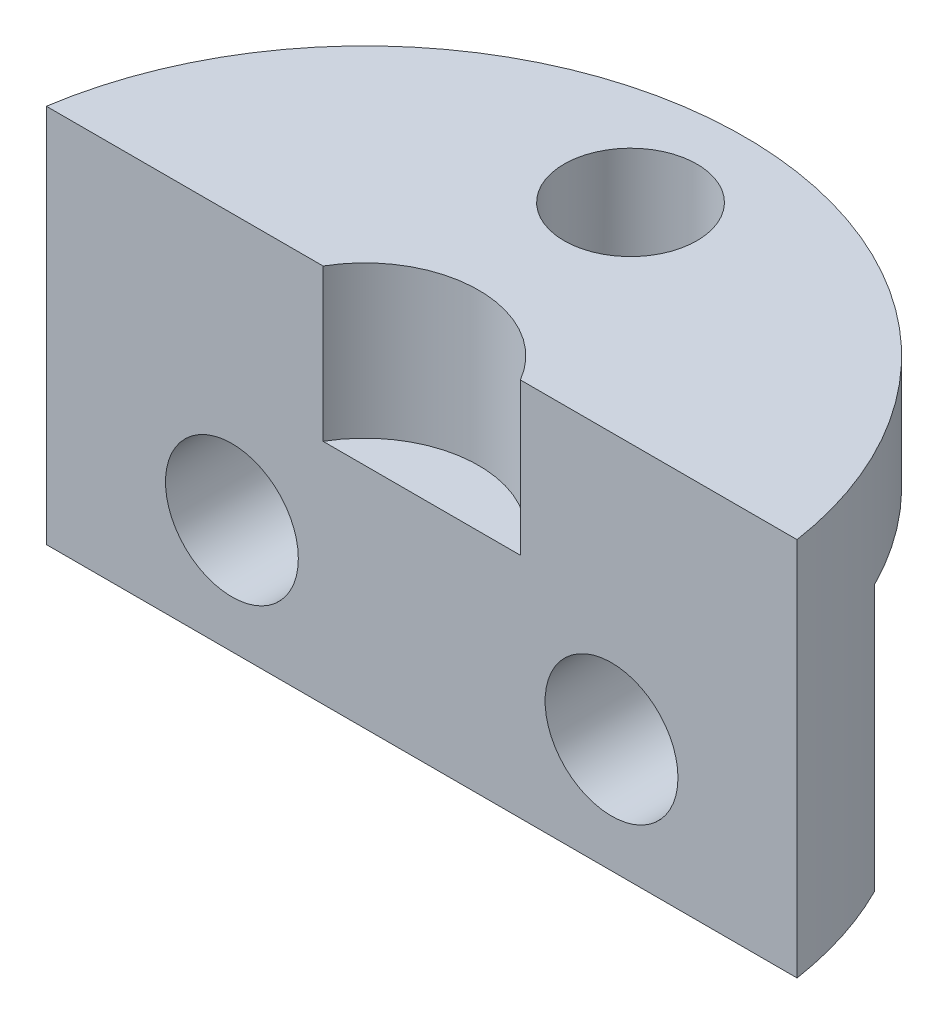
ISO-10303-21;
HEADER;
FILE_DESCRIPTION(('STEP AP214'),'2;1');
FILE_NAME('part.step','',(''),(''),'','','');
FILE_SCHEMA(('AUTOMOTIVE_DESIGN { 1 0 10303 214 1 1 1 1 }'));
ENDSEC;
DATA;
#1=APPLICATION_CONTEXT('core data for automotive mechanical design processes');
#2=APPLICATION_PROTOCOL_DEFINITION('international standard','automotive_design',2000,#1);
#3=PRODUCT_CONTEXT('',#1,'mechanical');
#4=PRODUCT('Part','Part','',(#3));
#5=PRODUCT_RELATED_PRODUCT_CATEGORY('part','',(#4));
#6=PRODUCT_DEFINITION_FORMATION('','',#4);
#7=PRODUCT_DEFINITION_CONTEXT('part definition',#1,'design');
#8=PRODUCT_DEFINITION('design','',#6,#7);
#9=PRODUCT_DEFINITION_SHAPE('','',#8);
#10=(LENGTH_UNIT() NAMED_UNIT(*) SI_UNIT(.MILLI.,.METRE.));
#11=(NAMED_UNIT(*) PLANE_ANGLE_UNIT() SI_UNIT($,.RADIAN.));
#12=(NAMED_UNIT(*) SI_UNIT($,.STERADIAN.) SOLID_ANGLE_UNIT());
#13=UNCERTAINTY_MEASURE_WITH_UNIT(LENGTH_MEASURE(1.E-05),#10,'distance_accuracy_value','');
#14=(GEOMETRIC_REPRESENTATION_CONTEXT(3) GLOBAL_UNCERTAINTY_ASSIGNED_CONTEXT((#13)) GLOBAL_UNIT_ASSIGNED_CONTEXT((#10,
#11,#12)) REPRESENTATION_CONTEXT('',''));
#15=CARTESIAN_POINT('',(0.,0.,0.));
#16=DIRECTION('',(0.,0.,1.));
#17=DIRECTION('',(1.,0.,0.));
#18=AXIS2_PLACEMENT_3D('',#15,#16,#17);
#19=CARTESIAN_POINT('',(0.,0.,-7.));
#20=DIRECTION('',(0.,1.,0.));
#21=DIRECTION('',(0.,0.,1.));
#22=AXIS2_PLACEMENT_3D('',#19,#20,#21);
#23=CYLINDRICAL_SURFACE('',#22,1.75);
#24=CARTESIAN_POINT('',(0.,10.,-7.));
#25=DIRECTION('',(0.,1.,0.));
#26=DIRECTION('',(0.,0.,1.));
#27=AXIS2_PLACEMENT_3D('',#24,#25,#26);
#28=CIRCLE('',#27,1.75);
#29=CARTESIAN_POINT('',(0.,10.,-5.25));
#30=VERTEX_POINT('',#29);
#31=EDGE_CURVE('E157',#30,#30,#28,.T.);
#32=ORIENTED_EDGE('',*,*,#31,.T.);
#33=EDGE_LOOP('',(#32));
#34=FACE_BOUND('',#33,.T.);
#35=CARTESIAN_POINT('',(0.,7.,-7.));
#36=DIRECTION('',(0.,-1.,0.));
#37=DIRECTION('',(0.,0.,-1.));
#38=AXIS2_PLACEMENT_3D('',#35,#36,#37);
#39=CIRCLE('',#38,1.75);
#40=CARTESIAN_POINT('',(0.,7.,-8.75));
#41=VERTEX_POINT('',#40);
#42=EDGE_CURVE('E137',#41,#41,#39,.F.);
#43=ORIENTED_EDGE('',*,*,#42,.F.);
#44=EDGE_LOOP('',(#43));
#45=FACE_BOUND('',#44,.T.);
#46=ADVANCED_FACE('F48',(#34,#45),#23,.F.);
#47=CARTESIAN_POINT('',(0.,10.,0.));
#48=DIRECTION('',(0.,-1.,0.));
#49=DIRECTION('',(0.,0.,-1.));
#50=AXIS2_PLACEMENT_3D('',#47,#48,#49);
#51=CYLINDRICAL_SURFACE('',#50,10.);
#52=CARTESIAN_POINT('',(0.,7.,0.));
#53=DIRECTION('',(0.,-1.,0.));
#54=DIRECTION('',(0.,0.,-1.));
#55=AXIS2_PLACEMENT_3D('',#52,#53,#54);
#56=CIRCLE('',#55,10.);
#57=CARTESIAN_POINT('',(-8.93028554974587,7.,-4.5));
#58=VERTEX_POINT('',#57);
#59=CARTESIAN_POINT('',(8.93028554974587,7.,-4.5));
#60=VERTEX_POINT('',#59);
#61=EDGE_CURVE('E117',#58,#60,#56,.T.);
#62=ORIENTED_EDGE('',*,*,#61,.F.);
#63=DIRECTION('',(0.,-1.,0.));
#64=VECTOR('',#63,1.);
#65=CARTESIAN_POINT('',(-8.93028554974587,10.,-4.5));
#66=LINE('',#65,#64);
#67=CARTESIAN_POINT('',(-8.93028554974587,0.,-4.5));
#68=VERTEX_POINT('',#67);
#69=EDGE_CURVE('E104',#58,#68,#66,.T.);
#70=ORIENTED_EDGE('',*,*,#69,.T.);
#71=CARTESIAN_POINT('',(0.,0.,0.));
#72=DIRECTION('',(0.,1.,0.));
#73=DIRECTION('',(0.,0.,1.));
#74=AXIS2_PLACEMENT_3D('',#71,#72,#73);
#75=CIRCLE('',#74,10.);
#76=CARTESIAN_POINT('',(-9.88685996664259,0.,-1.5));
#77=VERTEX_POINT('',#76);
#78=EDGE_CURVE('E115',#68,#77,#75,.T.);
#79=ORIENTED_EDGE('',*,*,#78,.T.);
#80=DIRECTION('',(0.,-1.,0.));
#81=VECTOR('',#80,1.);
#82=CARTESIAN_POINT('',(-9.88685996664259,10.,-1.5));
#83=LINE('',#82,#81);
#84=CARTESIAN_POINT('',(-9.88685996664259,10.,-1.5));
#85=VERTEX_POINT('',#84);
#86=EDGE_CURVE('E124',#85,#77,#83,.T.);
#87=ORIENTED_EDGE('',*,*,#86,.F.);
#88=CARTESIAN_POINT('',(0.,10.,0.));
#89=DIRECTION('',(0.,1.,0.));
#90=DIRECTION('',(0.,0.,1.));
#91=AXIS2_PLACEMENT_3D('',#88,#89,#90);
#92=CIRCLE('',#91,10.);
#93=CARTESIAN_POINT('',(9.88685996664259,10.,-1.5));
#94=VERTEX_POINT('',#93);
#95=EDGE_CURVE('E126',#94,#85,#92,.T.);
#96=ORIENTED_EDGE('',*,*,#95,.F.);
#97=DIRECTION('',(0.,-1.,0.));
#98=VECTOR('',#97,1.);
#99=CARTESIAN_POINT('',(9.88685996664259,10.,-1.5));
#100=LINE('',#99,#98);
#101=CARTESIAN_POINT('',(9.88685996664259,0.,-1.5));
#102=VERTEX_POINT('',#101);
#103=EDGE_CURVE('E127',#102,#94,#100,.F.);
#104=ORIENTED_EDGE('',*,*,#103,.F.);
#105=CARTESIAN_POINT('',(8.93028554974587,0.,-4.5));
#106=VERTEX_POINT('',#105);
#107=EDGE_CURVE('E123',#102,#106,#75,.T.);
#108=ORIENTED_EDGE('',*,*,#107,.T.);
#109=DIRECTION('',(0.,-1.,0.));
#110=VECTOR('',#109,1.);
#111=CARTESIAN_POINT('',(8.93028554974587,10.,-4.5));
#112=LINE('',#111,#110);
#113=EDGE_CURVE('E66',#106,#60,#112,.F.);
#114=ORIENTED_EDGE('',*,*,#113,.T.);
#115=EDGE_LOOP('',(#62,#70,#79,#87,#96,#104,#108,#114));
#116=FACE_BOUND('',#115,.T.);
#117=ADVANCED_FACE('F50',(#116),#51,.T.);
#118=CARTESIAN_POINT('',(0.,10.,0.));
#119=DIRECTION('',(0.,1.,0.));
#120=DIRECTION('',(0.,0.,1.));
#121=AXIS2_PLACEMENT_3D('',#118,#119,#120);
#122=PLANE('',#121);
#123=CARTESIAN_POINT('',(0.,10.,0.));
#124=DIRECTION('',(0.,1.,0.));
#125=DIRECTION('',(0.,0.,1.));
#126=AXIS2_PLACEMENT_3D('',#123,#124,#125);
#127=CIRCLE('',#126,3.);
#128=CARTESIAN_POINT('',(2.59807621135332,10.,-1.5));
#129=VERTEX_POINT('',#128);
#130=CARTESIAN_POINT('',(-2.59807621135332,10.,-1.5));
#131=VERTEX_POINT('',#130);
#132=EDGE_CURVE('E118',#129,#131,#127,.T.);
#133=ORIENTED_EDGE('',*,*,#132,.F.);
#134=DIRECTION('',(-1.,0.,0.));
#135=VECTOR('',#134,1.);
#136=CARTESIAN_POINT('',(-12.3821259592804,10.,-1.5));
#137=LINE('',#136,#135);
#138=EDGE_CURVE('E163',#94,#129,#137,.T.);
#139=ORIENTED_EDGE('',*,*,#138,.F.);
#140=ORIENTED_EDGE('',*,*,#95,.T.);
#141=EDGE_CURVE('E162',#131,#85,#137,.T.);
#142=ORIENTED_EDGE('',*,*,#141,.F.);
#143=EDGE_LOOP('',(#133,#139,#140,#142));
#144=FACE_BOUND('',#143,.T.);
#145=ORIENTED_EDGE('',*,*,#31,.F.);
#146=EDGE_LOOP('',(#145));
#147=FACE_BOUND('',#146,.T.);
#148=ADVANCED_FACE('F176',(#144,#147),#122,.T.);
#149=CARTESIAN_POINT('',(0.,0.,0.));
#150=DIRECTION('',(0.,1.,0.));
#151=DIRECTION('',(0.,0.,1.));
#152=AXIS2_PLACEMENT_3D('',#149,#150,#151);
#153=PLANE('',#152);
#154=ORIENTED_EDGE('',*,*,#78,.F.);
#155=DIRECTION('',(-1.,0.,0.));
#156=VECTOR('',#155,1.);
#157=CARTESIAN_POINT('',(-11.0044625093905,0.,-4.5));
#158=LINE('',#157,#156);
#159=EDGE_CURVE('E101',#106,#68,#158,.T.);
#160=ORIENTED_EDGE('',*,*,#159,.F.);
#161=ORIENTED_EDGE('',*,*,#107,.F.);
#162=DIRECTION('',(1.,0.,0.));
#163=VECTOR('',#162,1.);
#164=CARTESIAN_POINT('',(0.,0.,-1.5));
#165=LINE('',#164,#163);
#166=EDGE_CURVE('E122',#77,#102,#165,.T.);
#167=ORIENTED_EDGE('',*,*,#166,.F.);
#168=EDGE_LOOP('',(#154,#160,#161,#167));
#169=FACE_BOUND('',#168,.T.);
#170=ADVANCED_FACE('F121',(#169),#153,.F.);
#171=CARTESIAN_POINT('',(-12.3821259592804,10.,-1.5));
#172=DIRECTION('',(0.,0.,1.));
#173=DIRECTION('',(1.,0.,0.));
#174=AXIS2_PLACEMENT_3D('',#171,#172,#173);
#175=PLANE('',#174);
#176=CARTESIAN_POINT('',(-5.,3.,-1.5));
#177=DIRECTION('',(0.,0.,1.));
#178=DIRECTION('',(1.,0.,0.));
#179=AXIS2_PLACEMENT_3D('',#176,#177,#178);
#180=CIRCLE('',#179,1.75);
#181=CARTESIAN_POINT('',(-3.25,3.,-1.5));
#182=VERTEX_POINT('',#181);
#183=EDGE_CURVE('E141',#182,#182,#180,.T.);
#184=ORIENTED_EDGE('',*,*,#183,.F.);
#185=EDGE_LOOP('',(#184));
#186=FACE_BOUND('',#185,.T.);
#187=CARTESIAN_POINT('',(5.,3.,-1.5));
#188=DIRECTION('',(0.,0.,1.));
#189=DIRECTION('',(1.,0.,0.));
#190=AXIS2_PLACEMENT_3D('',#187,#188,#189);
#191=CIRCLE('',#190,1.75);
#192=CARTESIAN_POINT('',(6.75,3.,-1.5));
#193=VERTEX_POINT('',#192);
#194=EDGE_CURVE('E146',#193,#193,#191,.T.);
#195=ORIENTED_EDGE('',*,*,#194,.F.);
#196=EDGE_LOOP('',(#195));
#197=FACE_BOUND('',#196,.T.);
#198=DIRECTION('',(0.,1.,0.));
#199=VECTOR('',#198,1.);
#200=CARTESIAN_POINT('',(2.59807621135332,6.,-1.5));
#201=LINE('',#200,#199);
#202=CARTESIAN_POINT('',(2.59807621135332,6.,-1.5));
#203=VERTEX_POINT('',#202);
#204=EDGE_CURVE('E13',#203,#129,#201,.T.);
#205=ORIENTED_EDGE('',*,*,#204,.F.);
#206=DIRECTION('',(-1.,0.,0.));
#207=VECTOR('',#206,1.);
#208=CARTESIAN_POINT('',(-12.3821259592804,6.,-1.5));
#209=LINE('',#208,#207);
#210=CARTESIAN_POINT('',(-2.59807621135332,6.,-1.5));
#211=VERTEX_POINT('',#210);
#212=EDGE_CURVE('E132',#203,#211,#209,.T.);
#213=ORIENTED_EDGE('',*,*,#212,.T.);
#214=DIRECTION('',(0.,1.,0.));
#215=VECTOR('',#214,1.);
#216=CARTESIAN_POINT('',(-2.59807621135332,6.,-1.5));
#217=LINE('',#216,#215);
#218=EDGE_CURVE('E58',#131,#211,#217,.F.);
#219=ORIENTED_EDGE('',*,*,#218,.F.);
#220=ORIENTED_EDGE('',*,*,#141,.T.);
#221=ORIENTED_EDGE('',*,*,#86,.T.);
#222=ORIENTED_EDGE('',*,*,#166,.T.);
#223=ORIENTED_EDGE('',*,*,#103,.T.);
#224=ORIENTED_EDGE('',*,*,#138,.T.);
#225=EDGE_LOOP('',(#205,#213,#219,#220,#221,#222,#223,#224));
#226=FACE_BOUND('',#225,.T.);
#227=ADVANCED_FACE('F171',(#186,#197,#226),#175,.T.);
#228=CARTESIAN_POINT('',(0.,6.,0.));
#229=DIRECTION('',(0.,1.,0.));
#230=DIRECTION('',(0.,0.,1.));
#231=AXIS2_PLACEMENT_3D('',#228,#229,#230);
#232=CYLINDRICAL_SURFACE('',#231,3.);
#233=ORIENTED_EDGE('',*,*,#204,.T.);
#234=ORIENTED_EDGE('',*,*,#132,.T.);
#235=ORIENTED_EDGE('',*,*,#218,.T.);
#236=CARTESIAN_POINT('',(0.,6.,0.));
#237=DIRECTION('',(0.,1.,0.));
#238=DIRECTION('',(0.,0.,1.));
#239=AXIS2_PLACEMENT_3D('',#236,#237,#238);
#240=CIRCLE('',#239,3.);
#241=EDGE_CURVE('E73',#203,#211,#240,.T.);
#242=ORIENTED_EDGE('',*,*,#241,.F.);
#243=EDGE_LOOP('',(#233,#234,#235,#242));
#244=FACE_BOUND('',#243,.T.);
#245=ADVANCED_FACE('F213',(#244),#232,.F.);
#246=CARTESIAN_POINT('',(0.,6.,0.));
#247=DIRECTION('',(0.,1.,0.));
#248=DIRECTION('',(0.,0.,1.));
#249=AXIS2_PLACEMENT_3D('',#246,#247,#248);
#250=PLANE('',#249);
#251=ORIENTED_EDGE('',*,*,#241,.T.);
#252=ORIENTED_EDGE('',*,*,#212,.F.);
#253=EDGE_LOOP('',(#251,#252));
#254=FACE_BOUND('',#253,.T.);
#255=ADVANCED_FACE('F221',(#254),#250,.T.);
#256=CARTESIAN_POINT('',(-11.0044625093905,7.,-4.5));
#257=DIRECTION('',(0.,0.,1.));
#258=DIRECTION('',(1.,0.,0.));
#259=AXIS2_PLACEMENT_3D('',#256,#257,#258);
#260=PLANE('',#259);
#261=CARTESIAN_POINT('',(-5.,3.,-4.5));
#262=DIRECTION('',(0.,0.,1.));
#263=DIRECTION('',(1.,0.,0.));
#264=AXIS2_PLACEMENT_3D('',#261,#262,#263);
#265=CIRCLE('',#264,1.75);
#266=CARTESIAN_POINT('',(-3.25,3.,-4.5));
#267=VERTEX_POINT('',#266);
#268=EDGE_CURVE('E52',#267,#267,#265,.T.);
#269=ORIENTED_EDGE('',*,*,#268,.T.);
#270=EDGE_LOOP('',(#269));
#271=FACE_BOUND('',#270,.T.);
#272=CARTESIAN_POINT('',(5.,3.,-4.5));
#273=DIRECTION('',(0.,0.,1.));
#274=DIRECTION('',(1.,0.,0.));
#275=AXIS2_PLACEMENT_3D('',#272,#273,#274);
#276=CIRCLE('',#275,1.75);
#277=CARTESIAN_POINT('',(6.75,3.,-4.5));
#278=VERTEX_POINT('',#277);
#279=EDGE_CURVE('E139',#278,#278,#276,.T.);
#280=ORIENTED_EDGE('',*,*,#279,.T.);
#281=EDGE_LOOP('',(#280));
#282=FACE_BOUND('',#281,.T.);
#283=DIRECTION('',(-1.,0.,0.));
#284=VECTOR('',#283,1.);
#285=CARTESIAN_POINT('',(-11.0044625093905,7.,-4.5));
#286=LINE('',#285,#284);
#287=EDGE_CURVE('E110',#60,#58,#286,.T.);
#288=ORIENTED_EDGE('',*,*,#287,.F.);
#289=ORIENTED_EDGE('',*,*,#113,.F.);
#290=ORIENTED_EDGE('',*,*,#159,.T.);
#291=ORIENTED_EDGE('',*,*,#69,.F.);
#292=EDGE_LOOP('',(#288,#289,#290,#291));
#293=FACE_BOUND('',#292,.T.);
#294=ADVANCED_FACE('F103',(#271,#282,#293),#260,.F.);
#295=CARTESIAN_POINT('',(0.,7.,0.));
#296=DIRECTION('',(0.,-1.,0.));
#297=DIRECTION('',(0.,0.,-1.));
#298=AXIS2_PLACEMENT_3D('',#295,#296,#297);
#299=PLANE('',#298);
#300=ORIENTED_EDGE('',*,*,#42,.T.);
#301=EDGE_LOOP('',(#300));
#302=FACE_BOUND('',#301,.T.);
#303=ORIENTED_EDGE('',*,*,#61,.T.);
#304=ORIENTED_EDGE('',*,*,#287,.T.);
#305=EDGE_LOOP('',(#303,#304));
#306=FACE_BOUND('',#305,.T.);
#307=ADVANCED_FACE('F234',(#302,#306),#299,.T.);
#308=CARTESIAN_POINT('',(5.,3.,-8.5));
#309=DIRECTION('',(0.,0.,1.));
#310=DIRECTION('',(1.,0.,0.));
#311=AXIS2_PLACEMENT_3D('',#308,#309,#310);
#312=CYLINDRICAL_SURFACE('',#311,1.75);
#313=ORIENTED_EDGE('',*,*,#194,.T.);
#314=EDGE_LOOP('',(#313));
#315=FACE_BOUND('',#314,.T.);
#316=ORIENTED_EDGE('',*,*,#279,.F.);
#317=EDGE_LOOP('',(#316));
#318=FACE_BOUND('',#317,.T.);
#319=ADVANCED_FACE('F242',(#315,#318),#312,.F.);
#320=CARTESIAN_POINT('',(-5.,3.,-8.5));
#321=DIRECTION('',(0.,0.,1.));
#322=DIRECTION('',(1.,0.,0.));
#323=AXIS2_PLACEMENT_3D('',#320,#321,#322);
#324=CYLINDRICAL_SURFACE('',#323,1.75);
#325=ORIENTED_EDGE('',*,*,#183,.T.);
#326=EDGE_LOOP('',(#325));
#327=FACE_BOUND('',#326,.T.);
#328=ORIENTED_EDGE('',*,*,#268,.F.);
#329=EDGE_LOOP('',(#328));
#330=FACE_BOUND('',#329,.T.);
#331=ADVANCED_FACE('F249',(#327,#330),#324,.F.);
#332=CLOSED_SHELL('',(#46,#117,#148,#170,#227,#245,#255,#294,#307,#319,#331));
#333=MANIFOLD_SOLID_BREP('B2',#332);
#334=ADVANCED_BREP_SHAPE_REPRESENTATION('',(#18,#333),#14);
#335=SHAPE_DEFINITION_REPRESENTATION(#9,#334);
ENDSEC;
END-ISO-10303-21;
